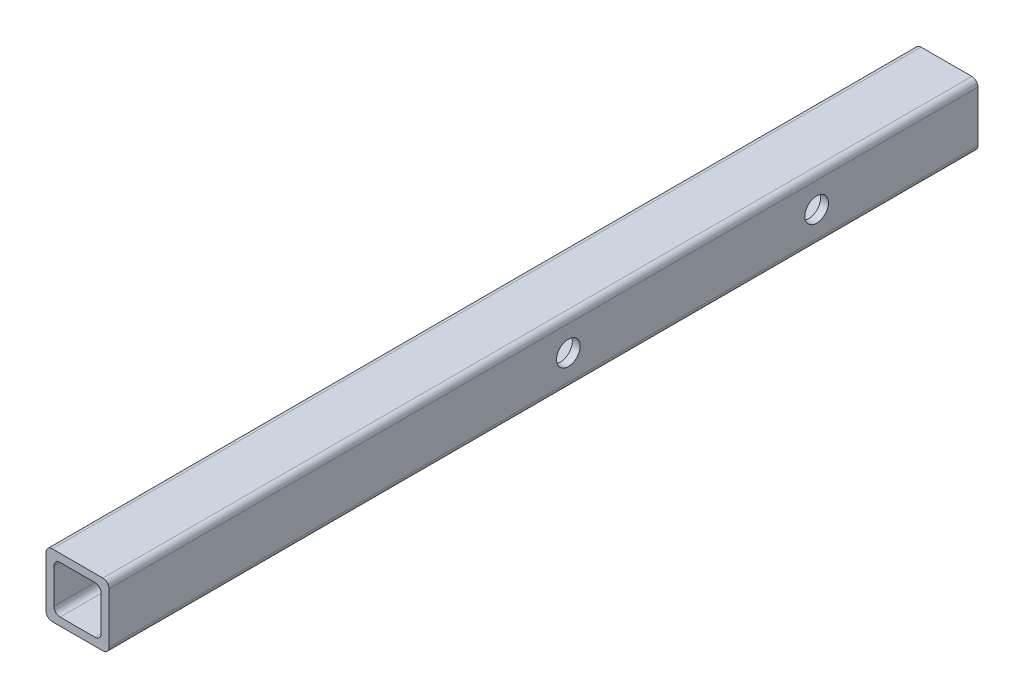
ISO-10303-21;
HEADER;
FILE_DESCRIPTION(('STEP AP214'),'2;1');
FILE_NAME('part.step','',(''),(''),'','','');
FILE_SCHEMA(('AUTOMOTIVE_DESIGN { 1 0 10303 214 1 1 1 1 }'));
ENDSEC;
DATA;
#1=APPLICATION_CONTEXT('core data for automotive mechanical design processes');
#2=APPLICATION_PROTOCOL_DEFINITION('international standard','automotive_design',2000,#1);
#3=PRODUCT_CONTEXT('',#1,'mechanical');
#4=PRODUCT('Part','Part','',(#3));
#5=PRODUCT_RELATED_PRODUCT_CATEGORY('part','',(#4));
#6=PRODUCT_DEFINITION_FORMATION('','',#4);
#7=PRODUCT_DEFINITION_CONTEXT('part definition',#1,'design');
#8=PRODUCT_DEFINITION('design','',#6,#7);
#9=PRODUCT_DEFINITION_SHAPE('','',#8);
#10=(LENGTH_UNIT() NAMED_UNIT(*) SI_UNIT(.MILLI.,.METRE.));
#11=(NAMED_UNIT(*) PLANE_ANGLE_UNIT() SI_UNIT($,.RADIAN.));
#12=(NAMED_UNIT(*) SI_UNIT($,.STERADIAN.) SOLID_ANGLE_UNIT());
#13=UNCERTAINTY_MEASURE_WITH_UNIT(LENGTH_MEASURE(1.E-05),#10,'distance_accuracy_value','');
#14=(GEOMETRIC_REPRESENTATION_CONTEXT(3) GLOBAL_UNCERTAINTY_ASSIGNED_CONTEXT((#13)) GLOBAL_UNIT_ASSIGNED_CONTEXT((#10,
#11,#12)) REPRESENTATION_CONTEXT('',''));
#15=CARTESIAN_POINT('',(0.,0.,0.));
#16=DIRECTION('',(0.,0.,1.));
#17=DIRECTION('',(1.,0.,0.));
#18=AXIS2_PLACEMENT_3D('',#15,#16,#17);
#19=CARTESIAN_POINT('',(10.2,-10.2,350.));
#20=DIRECTION('',(0.,0.,-1.));
#21=DIRECTION('',(-1.,0.,0.));
#22=AXIS2_PLACEMENT_3D('',#19,#20,#21);
#23=PLANE('',#22);
#24=CARTESIAN_POINT('',(10.2,-10.2,350.));
#25=DIRECTION('',(0.,0.,1.));
#26=DIRECTION('',(-1.,0.,0.));
#27=AXIS2_PLACEMENT_3D('',#24,#25,#26);
#28=CIRCLE('',#27,2.5);
#29=CARTESIAN_POINT('',(10.2,-12.7,350.));
#30=VERTEX_POINT('',#29);
#31=CARTESIAN_POINT('',(12.7,-10.2,350.));
#32=VERTEX_POINT('',#31);
#33=EDGE_CURVE('E245',#30,#32,#28,.T.);
#34=ORIENTED_EDGE('',*,*,#33,.T.);
#35=DIRECTION('',(0.,1.,0.));
#36=VECTOR('',#35,1.);
#37=CARTESIAN_POINT('',(12.7,-10.2,350.));
#38=LINE('',#37,#36);
#39=CARTESIAN_POINT('',(12.7,10.2,350.));
#40=VERTEX_POINT('',#39);
#41=EDGE_CURVE('E249',#32,#40,#38,.T.);
#42=ORIENTED_EDGE('',*,*,#41,.T.);
#43=CARTESIAN_POINT('',(10.2,10.2,350.));
#44=DIRECTION('',(0.,0.,1.));
#45=DIRECTION('',(1.,0.,0.));
#46=AXIS2_PLACEMENT_3D('',#43,#44,#45);
#47=CIRCLE('',#46,2.5);
#48=CARTESIAN_POINT('',(10.2,12.7,350.));
#49=VERTEX_POINT('',#48);
#50=EDGE_CURVE('E253',#40,#49,#47,.T.);
#51=ORIENTED_EDGE('',*,*,#50,.T.);
#52=DIRECTION('',(-1.,0.,0.));
#53=VECTOR('',#52,1.);
#54=CARTESIAN_POINT('',(-10.2,12.7,350.));
#55=LINE('',#54,#53);
#56=CARTESIAN_POINT('',(-10.2,12.7,350.));
#57=VERTEX_POINT('',#56);
#58=EDGE_CURVE('E256',#49,#57,#55,.T.);
#59=ORIENTED_EDGE('',*,*,#58,.T.);
#60=CARTESIAN_POINT('',(-10.2,10.2,350.));
#61=DIRECTION('',(0.,0.,1.));
#62=DIRECTION('',(1.,0.,0.));
#63=AXIS2_PLACEMENT_3D('',#60,#61,#62);
#64=CIRCLE('',#63,2.5);
#65=CARTESIAN_POINT('',(-12.7,10.2,350.));
#66=VERTEX_POINT('',#65);
#67=EDGE_CURVE('E259',#57,#66,#64,.T.);
#68=ORIENTED_EDGE('',*,*,#67,.T.);
#69=DIRECTION('',(0.,-1.,0.));
#70=VECTOR('',#69,1.);
#71=CARTESIAN_POINT('',(-12.7,-10.2,350.));
#72=LINE('',#71,#70);
#73=CARTESIAN_POINT('',(-12.7,-10.2,350.));
#74=VERTEX_POINT('',#73);
#75=EDGE_CURVE('E262',#66,#74,#72,.T.);
#76=ORIENTED_EDGE('',*,*,#75,.T.);
#77=CARTESIAN_POINT('',(-10.2,-10.2,350.));
#78=DIRECTION('',(0.,0.,1.));
#79=DIRECTION('',(-1.,0.,0.));
#80=AXIS2_PLACEMENT_3D('',#77,#78,#79);
#81=CIRCLE('',#80,2.5);
#82=CARTESIAN_POINT('',(-10.2,-12.7,350.));
#83=VERTEX_POINT('',#82);
#84=EDGE_CURVE('E265',#74,#83,#81,.T.);
#85=ORIENTED_EDGE('',*,*,#84,.T.);
#86=DIRECTION('',(1.,0.,0.));
#87=VECTOR('',#86,1.);
#88=CARTESIAN_POINT('',(-10.2,-12.7,350.));
#89=LINE('',#88,#87);
#90=EDGE_CURVE('E268',#83,#30,#89,.T.);
#91=ORIENTED_EDGE('',*,*,#90,.T.);
#92=EDGE_LOOP('',(#34,#42,#51,#59,#68,#76,#85,#91));
#93=FACE_BOUND('',#92,.T.);
#94=CARTESIAN_POINT('',(-7.02500000000001,-7.02499999999998,350.));
#95=DIRECTION('',(0.,0.,1.));
#96=DIRECTION('',(-1.,0.,0.));
#97=AXIS2_PLACEMENT_3D('',#94,#95,#96);
#98=CIRCLE('',#97,2.5);
#99=CARTESIAN_POINT('',(-9.52500000000001,-7.02499999999998,350.));
#100=VERTEX_POINT('',#99);
#101=CARTESIAN_POINT('',(-7.02500000000001,-9.52499999999998,350.));
#102=VERTEX_POINT('',#101);
#103=EDGE_CURVE('E154',#100,#102,#98,.T.);
#104=ORIENTED_EDGE('',*,*,#103,.F.);
#105=DIRECTION('',(0.,-1.,0.));
#106=VECTOR('',#105,1.);
#107=CARTESIAN_POINT('',(-9.52500000000001,-7.02499999999998,350.));
#108=LINE('',#107,#106);
#109=CARTESIAN_POINT('',(-9.52500000000001,7.025,350.));
#110=VERTEX_POINT('',#109);
#111=EDGE_CURVE('E196',#110,#100,#108,.T.);
#112=ORIENTED_EDGE('',*,*,#111,.F.);
#113=CARTESIAN_POINT('',(-7.025,7.025,350.));
#114=DIRECTION('',(0.,0.,1.));
#115=DIRECTION('',(-1.,0.,0.));
#116=AXIS2_PLACEMENT_3D('',#113,#114,#115);
#117=CIRCLE('',#116,2.5);
#118=CARTESIAN_POINT('',(-7.025,9.52500000000001,350.));
#119=VERTEX_POINT('',#118);
#120=EDGE_CURVE('E193',#119,#110,#117,.T.);
#121=ORIENTED_EDGE('',*,*,#120,.F.);
#122=DIRECTION('',(-1.,0.,0.));
#123=VECTOR('',#122,1.);
#124=CARTESIAN_POINT('',(-7.025,9.52500000000001,350.));
#125=LINE('',#124,#123);
#126=CARTESIAN_POINT('',(7.02499999999999,9.52500000000001,350.));
#127=VERTEX_POINT('',#126);
#128=EDGE_CURVE('E190',#127,#119,#125,.T.);
#129=ORIENTED_EDGE('',*,*,#128,.F.);
#130=CARTESIAN_POINT('',(7.02499999999999,7.025,350.));
#131=DIRECTION('',(0.,0.,1.));
#132=DIRECTION('',(1.,0.,0.));
#133=AXIS2_PLACEMENT_3D('',#130,#131,#132);
#134=CIRCLE('',#133,2.5);
#135=CARTESIAN_POINT('',(9.52499999999999,7.025,350.));
#136=VERTEX_POINT('',#135);
#137=EDGE_CURVE('E187',#136,#127,#134,.T.);
#138=ORIENTED_EDGE('',*,*,#137,.F.);
#139=DIRECTION('',(0.,1.,0.));
#140=VECTOR('',#139,1.);
#141=CARTESIAN_POINT('',(9.52499999999999,-7.02499999999998,350.));
#142=LINE('',#141,#140);
#143=CARTESIAN_POINT('',(9.52499999999999,-7.02499999999998,350.));
#144=VERTEX_POINT('',#143);
#145=EDGE_CURVE('E181',#144,#136,#142,.T.);
#146=ORIENTED_EDGE('',*,*,#145,.F.);
#147=CARTESIAN_POINT('',(7.02499999999999,-7.02499999999998,350.));
#148=DIRECTION('',(0.,0.,1.));
#149=DIRECTION('',(1.,0.,0.));
#150=AXIS2_PLACEMENT_3D('',#147,#148,#149);
#151=CIRCLE('',#150,2.5);
#152=CARTESIAN_POINT('',(7.02499999999999,-9.52499999999998,350.));
#153=VERTEX_POINT('',#152);
#154=EDGE_CURVE('E177',#153,#144,#151,.T.);
#155=ORIENTED_EDGE('',*,*,#154,.F.);
#156=DIRECTION('',(1.,0.,0.));
#157=VECTOR('',#156,1.);
#158=CARTESIAN_POINT('',(-7.02500000000001,-9.52499999999998,350.));
#159=LINE('',#158,#157);
#160=EDGE_CURVE('E163',#102,#153,#159,.T.);
#161=ORIENTED_EDGE('',*,*,#160,.F.);
#162=EDGE_LOOP('',(#104,#112,#121,#129,#138,#146,#155,#161));
#163=FACE_BOUND('',#162,.T.);
#164=ADVANCED_FACE('F38',(#93,#163),#23,.F.);
#165=CARTESIAN_POINT('',(10.2,-10.2,0.));
#166=DIRECTION('',(0.,0.,-1.));
#167=DIRECTION('',(-1.,0.,0.));
#168=AXIS2_PLACEMENT_3D('',#165,#166,#167);
#169=PLANE('',#168);
#170=CARTESIAN_POINT('',(10.2,-10.2,0.));
#171=DIRECTION('',(0.,0.,1.));
#172=DIRECTION('',(-1.,0.,0.));
#173=AXIS2_PLACEMENT_3D('',#170,#171,#172);
#174=CIRCLE('',#173,2.5);
#175=CARTESIAN_POINT('',(10.2,-12.7,0.));
#176=VERTEX_POINT('',#175);
#177=CARTESIAN_POINT('',(12.7,-10.2,0.));
#178=VERTEX_POINT('',#177);
#179=EDGE_CURVE('E172',#176,#178,#174,.T.);
#180=ORIENTED_EDGE('',*,*,#179,.F.);
#181=DIRECTION('',(1.,0.,0.));
#182=VECTOR('',#181,1.);
#183=CARTESIAN_POINT('',(-10.2,-12.7,0.));
#184=LINE('',#183,#182);
#185=CARTESIAN_POINT('',(-10.2,-12.7,0.));
#186=VERTEX_POINT('',#185);
#187=EDGE_CURVE('E250',#186,#176,#184,.T.);
#188=ORIENTED_EDGE('',*,*,#187,.F.);
#189=CARTESIAN_POINT('',(-10.2,-10.2,0.));
#190=DIRECTION('',(0.,0.,1.));
#191=DIRECTION('',(-1.,0.,0.));
#192=AXIS2_PLACEMENT_3D('',#189,#190,#191);
#193=CIRCLE('',#192,2.5);
#194=CARTESIAN_POINT('',(-12.7,-10.2,0.));
#195=VERTEX_POINT('',#194);
#196=EDGE_CURVE('E290',#195,#186,#193,.T.);
#197=ORIENTED_EDGE('',*,*,#196,.F.);
#198=DIRECTION('',(0.,-1.,0.));
#199=VECTOR('',#198,1.);
#200=CARTESIAN_POINT('',(-12.7,-10.2,0.));
#201=LINE('',#200,#199);
#202=CARTESIAN_POINT('',(-12.7,10.2,0.));
#203=VERTEX_POINT('',#202);
#204=EDGE_CURVE('E287',#203,#195,#201,.T.);
#205=ORIENTED_EDGE('',*,*,#204,.F.);
#206=CARTESIAN_POINT('',(-10.2,10.2,0.));
#207=DIRECTION('',(0.,0.,1.));
#208=DIRECTION('',(1.,0.,0.));
#209=AXIS2_PLACEMENT_3D('',#206,#207,#208);
#210=CIRCLE('',#209,2.5);
#211=CARTESIAN_POINT('',(-10.2,12.7,0.));
#212=VERTEX_POINT('',#211);
#213=EDGE_CURVE('E284',#212,#203,#210,.T.);
#214=ORIENTED_EDGE('',*,*,#213,.F.);
#215=DIRECTION('',(-1.,0.,0.));
#216=VECTOR('',#215,1.);
#217=CARTESIAN_POINT('',(-10.2,12.7,0.));
#218=LINE('',#217,#216);
#219=CARTESIAN_POINT('',(10.2,12.7,0.));
#220=VERTEX_POINT('',#219);
#221=EDGE_CURVE('E281',#220,#212,#218,.T.);
#222=ORIENTED_EDGE('',*,*,#221,.F.);
#223=CARTESIAN_POINT('',(10.2,10.2,0.));
#224=DIRECTION('',(0.,0.,1.));
#225=DIRECTION('',(1.,0.,0.));
#226=AXIS2_PLACEMENT_3D('',#223,#224,#225);
#227=CIRCLE('',#226,2.5);
#228=CARTESIAN_POINT('',(12.7,10.2,0.));
#229=VERTEX_POINT('',#228);
#230=EDGE_CURVE('E278',#229,#220,#227,.T.);
#231=ORIENTED_EDGE('',*,*,#230,.F.);
#232=DIRECTION('',(0.,1.,0.));
#233=VECTOR('',#232,1.);
#234=CARTESIAN_POINT('',(12.7,-10.2,0.));
#235=LINE('',#234,#233);
#236=EDGE_CURVE('E275',#178,#229,#235,.T.);
#237=ORIENTED_EDGE('',*,*,#236,.F.);
#238=EDGE_LOOP('',(#180,#188,#197,#205,#214,#222,#231,#237));
#239=FACE_BOUND('',#238,.T.);
#240=DIRECTION('',(0.,-1.,0.));
#241=VECTOR('',#240,1.);
#242=CARTESIAN_POINT('',(-9.52500000000001,-7.02499999999998,0.));
#243=LINE('',#242,#241);
#244=CARTESIAN_POINT('',(-9.52500000000001,7.02500000000001,0.));
#245=VERTEX_POINT('',#244);
#246=CARTESIAN_POINT('',(-9.52500000000001,-7.02499999999998,0.));
#247=VERTEX_POINT('',#246);
#248=EDGE_CURVE('E164',#245,#247,#243,.T.);
#249=ORIENTED_EDGE('',*,*,#248,.T.);
#250=CARTESIAN_POINT('',(-7.02500000000001,-7.02499999999998,0.));
#251=DIRECTION('',(0.,0.,1.));
#252=DIRECTION('',(-1.,0.,0.));
#253=AXIS2_PLACEMENT_3D('',#250,#251,#252);
#254=CIRCLE('',#253,2.5);
#255=CARTESIAN_POINT('',(-7.02500000000001,-9.52499999999998,0.));
#256=VERTEX_POINT('',#255);
#257=EDGE_CURVE('E64',#247,#256,#254,.T.);
#258=ORIENTED_EDGE('',*,*,#257,.T.);
#259=DIRECTION('',(1.,0.,0.));
#260=VECTOR('',#259,1.);
#261=CARTESIAN_POINT('',(-7.02500000000001,-9.52499999999998,0.));
#262=LINE('',#261,#260);
#263=CARTESIAN_POINT('',(7.02499999999999,-9.52499999999998,0.));
#264=VERTEX_POINT('',#263);
#265=EDGE_CURVE('E170',#256,#264,#262,.T.);
#266=ORIENTED_EDGE('',*,*,#265,.T.);
#267=CARTESIAN_POINT('',(7.02499999999999,-7.02499999999998,0.));
#268=DIRECTION('',(0.,0.,1.));
#269=DIRECTION('',(1.,0.,0.));
#270=AXIS2_PLACEMENT_3D('',#267,#268,#269);
#271=CIRCLE('',#270,2.5);
#272=CARTESIAN_POINT('',(9.52499999999999,-7.02499999999998,0.));
#273=VERTEX_POINT('',#272);
#274=EDGE_CURVE('E204',#264,#273,#271,.T.);
#275=ORIENTED_EDGE('',*,*,#274,.T.);
#276=DIRECTION('',(0.,1.,0.));
#277=VECTOR('',#276,1.);
#278=CARTESIAN_POINT('',(9.52499999999999,-7.02499999999998,0.));
#279=LINE('',#278,#277);
#280=CARTESIAN_POINT('',(9.52499999999999,7.025,0.));
#281=VERTEX_POINT('',#280);
#282=EDGE_CURVE('E208',#273,#281,#279,.T.);
#283=ORIENTED_EDGE('',*,*,#282,.T.);
#284=CARTESIAN_POINT('',(7.02499999999999,7.025,0.));
#285=DIRECTION('',(0.,0.,1.));
#286=DIRECTION('',(1.,0.,0.));
#287=AXIS2_PLACEMENT_3D('',#284,#285,#286);
#288=CIRCLE('',#287,2.5);
#289=CARTESIAN_POINT('',(7.02499999999999,9.52500000000001,0.));
#290=VERTEX_POINT('',#289);
#291=EDGE_CURVE('E212',#281,#290,#288,.T.);
#292=ORIENTED_EDGE('',*,*,#291,.T.);
#293=DIRECTION('',(-1.,0.,0.));
#294=VECTOR('',#293,1.);
#295=CARTESIAN_POINT('',(-7.025,9.52500000000001,0.));
#296=LINE('',#295,#294);
#297=CARTESIAN_POINT('',(-7.025,9.52500000000001,0.));
#298=VERTEX_POINT('',#297);
#299=EDGE_CURVE('E216',#290,#298,#296,.T.);
#300=ORIENTED_EDGE('',*,*,#299,.T.);
#301=CARTESIAN_POINT('',(-7.025,7.025,0.));
#302=DIRECTION('',(0.,0.,1.));
#303=DIRECTION('',(-1.,0.,0.));
#304=AXIS2_PLACEMENT_3D('',#301,#302,#303);
#305=CIRCLE('',#304,2.5);
#306=EDGE_CURVE('E220',#298,#245,#305,.T.);
#307=ORIENTED_EDGE('',*,*,#306,.T.);
#308=EDGE_LOOP('',(#249,#258,#266,#275,#283,#292,#300,#307));
#309=FACE_BOUND('',#308,.T.);
#310=ADVANCED_FACE('F366',(#239,#309),#169,.T.);
#311=CARTESIAN_POINT('',(10.2,-10.2,350.));
#312=DIRECTION('',(0.,0.,-1.));
#313=DIRECTION('',(-1.,0.,0.));
#314=AXIS2_PLACEMENT_3D('',#311,#312,#313);
#315=CYLINDRICAL_SURFACE('',#314,2.5);
#316=ORIENTED_EDGE('',*,*,#179,.T.);
#317=DIRECTION('',(0.,0.,-1.));
#318=VECTOR('',#317,1.);
#319=CARTESIAN_POINT('',(12.7,-10.2,350.));
#320=LINE('',#319,#318);
#321=EDGE_CURVE('E11',#32,#178,#320,.T.);
#322=ORIENTED_EDGE('',*,*,#321,.F.);
#323=ORIENTED_EDGE('',*,*,#33,.F.);
#324=DIRECTION('',(0.,0.,-1.));
#325=VECTOR('',#324,1.);
#326=CARTESIAN_POINT('',(10.2,-12.7,350.));
#327=LINE('',#326,#325);
#328=EDGE_CURVE('E271',#30,#176,#327,.T.);
#329=ORIENTED_EDGE('',*,*,#328,.T.);
#330=EDGE_LOOP('',(#316,#322,#323,#329));
#331=FACE_BOUND('',#330,.T.);
#332=ADVANCED_FACE('F40',(#331),#315,.T.);
#333=CARTESIAN_POINT('',(12.7,-10.2,350.));
#334=DIRECTION('',(-1.,0.,0.));
#335=DIRECTION('',(0.,-1.,0.));
#336=AXIS2_PLACEMENT_3D('',#333,#334,#335);
#337=PLANE('',#336);
#338=CARTESIAN_POINT('',(12.7,0.,65.));
#339=DIRECTION('',(-1.,0.,0.));
#340=DIRECTION('',(0.,0.,1.));
#341=AXIS2_PLACEMENT_3D('',#338,#339,#340);
#342=CIRCLE('',#341,4.7625);
#343=CARTESIAN_POINT('',(12.7,0.,69.7625));
#344=VERTEX_POINT('',#343);
#345=EDGE_CURVE('E324',#344,#344,#342,.T.);
#346=ORIENTED_EDGE('',*,*,#345,.T.);
#347=EDGE_LOOP('',(#346));
#348=FACE_BOUND('',#347,.T.);
#349=CARTESIAN_POINT('',(12.7,0.,165.));
#350=DIRECTION('',(-1.,0.,0.));
#351=DIRECTION('',(0.,0.,1.));
#352=AXIS2_PLACEMENT_3D('',#349,#350,#351);
#353=CIRCLE('',#352,4.76250000000001);
#354=CARTESIAN_POINT('',(12.7,0.,169.7625));
#355=VERTEX_POINT('',#354);
#356=EDGE_CURVE('E338',#355,#355,#353,.T.);
#357=ORIENTED_EDGE('',*,*,#356,.T.);
#358=EDGE_LOOP('',(#357));
#359=FACE_BOUND('',#358,.T.);
#360=ORIENTED_EDGE('',*,*,#236,.T.);
#361=DIRECTION('',(0.,0.,-1.));
#362=VECTOR('',#361,1.);
#363=CARTESIAN_POINT('',(12.7,10.2,350.));
#364=LINE('',#363,#362);
#365=EDGE_CURVE('E48',#40,#229,#364,.T.);
#366=ORIENTED_EDGE('',*,*,#365,.F.);
#367=ORIENTED_EDGE('',*,*,#41,.F.);
#368=ORIENTED_EDGE('',*,*,#321,.T.);
#369=EDGE_LOOP('',(#360,#366,#367,#368));
#370=FACE_BOUND('',#369,.T.);
#371=ADVANCED_FACE('F429',(#348,#359,#370),#337,.F.);
#372=CARTESIAN_POINT('',(10.2,10.2,350.));
#373=DIRECTION('',(0.,0.,-1.));
#374=DIRECTION('',(-1.,0.,0.));
#375=AXIS2_PLACEMENT_3D('',#372,#373,#374);
#376=CYLINDRICAL_SURFACE('',#375,2.5);
#377=ORIENTED_EDGE('',*,*,#230,.T.);
#378=DIRECTION('',(0.,0.,-1.));
#379=VECTOR('',#378,1.);
#380=CARTESIAN_POINT('',(10.2,12.7,350.));
#381=LINE('',#380,#379);
#382=EDGE_CURVE('E314',#49,#220,#381,.T.);
#383=ORIENTED_EDGE('',*,*,#382,.F.);
#384=ORIENTED_EDGE('',*,*,#50,.F.);
#385=ORIENTED_EDGE('',*,*,#365,.T.);
#386=EDGE_LOOP('',(#377,#383,#384,#385));
#387=FACE_BOUND('',#386,.T.);
#388=ADVANCED_FACE('F426',(#387),#376,.T.);
#389=CARTESIAN_POINT('',(-10.2,12.7,350.));
#390=DIRECTION('',(0.,-1.,0.));
#391=DIRECTION('',(1.,0.,0.));
#392=AXIS2_PLACEMENT_3D('',#389,#390,#391);
#393=PLANE('',#392);
#394=ORIENTED_EDGE('',*,*,#221,.T.);
#395=DIRECTION('',(0.,0.,-1.));
#396=VECTOR('',#395,1.);
#397=CARTESIAN_POINT('',(-10.2,12.7,350.));
#398=LINE('',#397,#396);
#399=EDGE_CURVE('E310',#57,#212,#398,.T.);
#400=ORIENTED_EDGE('',*,*,#399,.F.);
#401=ORIENTED_EDGE('',*,*,#58,.F.);
#402=ORIENTED_EDGE('',*,*,#382,.T.);
#403=EDGE_LOOP('',(#394,#400,#401,#402));
#404=FACE_BOUND('',#403,.T.);
#405=ADVANCED_FACE('F422',(#404),#393,.F.);
#406=CARTESIAN_POINT('',(-10.2,10.2,350.));
#407=DIRECTION('',(0.,0.,-1.));
#408=DIRECTION('',(-1.,0.,0.));
#409=AXIS2_PLACEMENT_3D('',#406,#407,#408);
#410=CYLINDRICAL_SURFACE('',#409,2.5);
#411=ORIENTED_EDGE('',*,*,#213,.T.);
#412=DIRECTION('',(0.,0.,-1.));
#413=VECTOR('',#412,1.);
#414=CARTESIAN_POINT('',(-12.7,10.2,350.));
#415=LINE('',#414,#413);
#416=EDGE_CURVE('E306',#66,#203,#415,.T.);
#417=ORIENTED_EDGE('',*,*,#416,.F.);
#418=ORIENTED_EDGE('',*,*,#67,.F.);
#419=ORIENTED_EDGE('',*,*,#399,.T.);
#420=EDGE_LOOP('',(#411,#417,#418,#419));
#421=FACE_BOUND('',#420,.T.);
#422=ADVANCED_FACE('F418',(#421),#410,.T.);
#423=CARTESIAN_POINT('',(-12.7,-10.2,350.));
#424=DIRECTION('',(1.,0.,0.));
#425=DIRECTION('',(0.,0.,-1.));
#426=AXIS2_PLACEMENT_3D('',#423,#424,#425);
#427=PLANE('',#426);
#428=CARTESIAN_POINT('',(-12.7,0.,65.));
#429=DIRECTION('',(-1.,0.,0.));
#430=DIRECTION('',(0.,0.,1.));
#431=AXIS2_PLACEMENT_3D('',#428,#429,#430);
#432=CIRCLE('',#431,4.7625);
#433=CARTESIAN_POINT('',(-12.7,0.,69.7625));
#434=VERTEX_POINT('',#433);
#435=EDGE_CURVE('E332',#434,#434,#432,.T.);
#436=ORIENTED_EDGE('',*,*,#435,.F.);
#437=EDGE_LOOP('',(#436));
#438=FACE_BOUND('',#437,.T.);
#439=CARTESIAN_POINT('',(-12.7,0.,165.));
#440=DIRECTION('',(-1.,0.,0.));
#441=DIRECTION('',(0.,0.,1.));
#442=AXIS2_PLACEMENT_3D('',#439,#440,#441);
#443=CIRCLE('',#442,4.76250000000001);
#444=CARTESIAN_POINT('',(-12.7,0.,169.7625));
#445=VERTEX_POINT('',#444);
#446=EDGE_CURVE('E344',#445,#445,#443,.T.);
#447=ORIENTED_EDGE('',*,*,#446,.F.);
#448=EDGE_LOOP('',(#447));
#449=FACE_BOUND('',#448,.T.);
#450=ORIENTED_EDGE('',*,*,#204,.T.);
#451=DIRECTION('',(0.,0.,-1.));
#452=VECTOR('',#451,1.);
#453=CARTESIAN_POINT('',(-12.7,-10.2,350.));
#454=LINE('',#453,#452);
#455=EDGE_CURVE('E302',#74,#195,#454,.T.);
#456=ORIENTED_EDGE('',*,*,#455,.F.);
#457=ORIENTED_EDGE('',*,*,#75,.F.);
#458=ORIENTED_EDGE('',*,*,#416,.T.);
#459=EDGE_LOOP('',(#450,#456,#457,#458));
#460=FACE_BOUND('',#459,.T.);
#461=ADVANCED_FACE('F414',(#438,#449,#460),#427,.F.);
#462=CARTESIAN_POINT('',(-10.2,-10.2,350.));
#463=DIRECTION('',(0.,0.,-1.));
#464=DIRECTION('',(-1.,0.,0.));
#465=AXIS2_PLACEMENT_3D('',#462,#463,#464);
#466=CYLINDRICAL_SURFACE('',#465,2.5);
#467=ORIENTED_EDGE('',*,*,#196,.T.);
#468=DIRECTION('',(0.,0.,-1.));
#469=VECTOR('',#468,1.);
#470=CARTESIAN_POINT('',(-10.2,-12.7,350.));
#471=LINE('',#470,#469);
#472=EDGE_CURVE('E298',#83,#186,#471,.T.);
#473=ORIENTED_EDGE('',*,*,#472,.F.);
#474=ORIENTED_EDGE('',*,*,#84,.F.);
#475=ORIENTED_EDGE('',*,*,#455,.T.);
#476=EDGE_LOOP('',(#467,#473,#474,#475));
#477=FACE_BOUND('',#476,.T.);
#478=ADVANCED_FACE('F410',(#477),#466,.T.);
#479=CARTESIAN_POINT('',(-10.2,-12.7,350.));
#480=DIRECTION('',(0.,1.,0.));
#481=DIRECTION('',(0.,0.,1.));
#482=AXIS2_PLACEMENT_3D('',#479,#480,#481);
#483=PLANE('',#482);
#484=ORIENTED_EDGE('',*,*,#187,.T.);
#485=ORIENTED_EDGE('',*,*,#328,.F.);
#486=ORIENTED_EDGE('',*,*,#90,.F.);
#487=ORIENTED_EDGE('',*,*,#472,.T.);
#488=EDGE_LOOP('',(#484,#485,#486,#487));
#489=FACE_BOUND('',#488,.T.);
#490=ADVANCED_FACE('F407',(#489),#483,.F.);
#491=CARTESIAN_POINT('',(-7.02500000000001,-7.02499999999998,350.));
#492=DIRECTION('',(0.,0.,-1.));
#493=DIRECTION('',(-1.,0.,0.));
#494=AXIS2_PLACEMENT_3D('',#491,#492,#493);
#495=CYLINDRICAL_SURFACE('',#494,2.5);
#496=ORIENTED_EDGE('',*,*,#257,.F.);
#497=DIRECTION('',(0.,0.,-1.));
#498=VECTOR('',#497,1.);
#499=CARTESIAN_POINT('',(-9.52500000000001,-7.02499999999998,350.));
#500=LINE('',#499,#498);
#501=EDGE_CURVE('E158',#100,#247,#500,.T.);
#502=ORIENTED_EDGE('',*,*,#501,.F.);
#503=ORIENTED_EDGE('',*,*,#103,.T.);
#504=DIRECTION('',(0.,0.,-1.));
#505=VECTOR('',#504,1.);
#506=CARTESIAN_POINT('',(-7.02500000000001,-9.52499999999998,350.));
#507=LINE('',#506,#505);
#508=EDGE_CURVE('E157',#102,#256,#507,.T.);
#509=ORIENTED_EDGE('',*,*,#508,.T.);
#510=EDGE_LOOP('',(#496,#502,#503,#509));
#511=FACE_BOUND('',#510,.T.);
#512=ADVANCED_FACE('F156',(#511),#495,.F.);
#513=CARTESIAN_POINT('',(-7.02500000000001,-9.52499999999998,350.));
#514=DIRECTION('',(0.,1.,0.));
#515=DIRECTION('',(0.,0.,1.));
#516=AXIS2_PLACEMENT_3D('',#513,#514,#515);
#517=PLANE('',#516);
#518=ORIENTED_EDGE('',*,*,#265,.F.);
#519=ORIENTED_EDGE('',*,*,#508,.F.);
#520=ORIENTED_EDGE('',*,*,#160,.T.);
#521=DIRECTION('',(0.,0.,-1.));
#522=VECTOR('',#521,1.);
#523=CARTESIAN_POINT('',(7.02499999999999,-9.52499999999998,350.));
#524=LINE('',#523,#522);
#525=EDGE_CURVE('E173',#153,#264,#524,.T.);
#526=ORIENTED_EDGE('',*,*,#525,.T.);
#527=EDGE_LOOP('',(#518,#519,#520,#526));
#528=FACE_BOUND('',#527,.T.);
#529=ADVANCED_FACE('F167',(#528),#517,.T.);
#530=CARTESIAN_POINT('',(7.02499999999999,-7.02499999999998,350.));
#531=DIRECTION('',(0.,0.,-1.));
#532=DIRECTION('',(-1.,0.,0.));
#533=AXIS2_PLACEMENT_3D('',#530,#531,#532);
#534=CYLINDRICAL_SURFACE('',#533,2.5);
#535=ORIENTED_EDGE('',*,*,#274,.F.);
#536=ORIENTED_EDGE('',*,*,#525,.F.);
#537=ORIENTED_EDGE('',*,*,#154,.T.);
#538=DIRECTION('',(0.,0.,-1.));
#539=VECTOR('',#538,1.);
#540=CARTESIAN_POINT('',(9.52499999999999,-7.02499999999998,350.));
#541=LINE('',#540,#539);
#542=EDGE_CURVE('E240',#144,#273,#541,.T.);
#543=ORIENTED_EDGE('',*,*,#542,.T.);
#544=EDGE_LOOP('',(#535,#536,#537,#543));
#545=FACE_BOUND('',#544,.T.);
#546=ADVANCED_FACE('F386',(#545),#534,.F.);
#547=CARTESIAN_POINT('',(9.52499999999999,-7.02499999999998,350.));
#548=DIRECTION('',(-1.,0.,0.));
#549=DIRECTION('',(0.,-1.,0.));
#550=AXIS2_PLACEMENT_3D('',#547,#548,#549);
#551=PLANE('',#550);
#552=CARTESIAN_POINT('',(9.52499999999999,0.,65.));
#553=DIRECTION('',(-1.,0.,0.));
#554=DIRECTION('',(0.,-1.,0.));
#555=AXIS2_PLACEMENT_3D('',#552,#553,#554);
#556=CIRCLE('',#555,4.7625);
#557=CARTESIAN_POINT('',(9.52499999999999,-4.7625,65.));
#558=VERTEX_POINT('',#557);
#559=EDGE_CURVE('E201',#558,#558,#556,.T.);
#560=ORIENTED_EDGE('',*,*,#559,.F.);
#561=EDGE_LOOP('',(#560));
#562=FACE_BOUND('',#561,.T.);
#563=CARTESIAN_POINT('',(9.52499999999999,0.,165.));
#564=DIRECTION('',(-1.,0.,0.));
#565=DIRECTION('',(0.,-1.,0.));
#566=AXIS2_PLACEMENT_3D('',#563,#564,#565);
#567=CIRCLE('',#566,4.76250000000001);
#568=CARTESIAN_POINT('',(9.52499999999999,-4.76250000000001,165.));
#569=VERTEX_POINT('',#568);
#570=EDGE_CURVE('E323',#569,#569,#567,.T.);
#571=ORIENTED_EDGE('',*,*,#570,.F.);
#572=EDGE_LOOP('',(#571));
#573=FACE_BOUND('',#572,.T.);
#574=ORIENTED_EDGE('',*,*,#282,.F.);
#575=ORIENTED_EDGE('',*,*,#542,.F.);
#576=ORIENTED_EDGE('',*,*,#145,.T.);
#577=DIRECTION('',(0.,0.,-1.));
#578=VECTOR('',#577,1.);
#579=CARTESIAN_POINT('',(9.52499999999999,7.025,350.));
#580=LINE('',#579,#578);
#581=EDGE_CURVE('E237',#136,#281,#580,.T.);
#582=ORIENTED_EDGE('',*,*,#581,.T.);
#583=EDGE_LOOP('',(#574,#575,#576,#582));
#584=FACE_BOUND('',#583,.T.);
#585=ADVANCED_FACE('F382',(#562,#573,#584),#551,.T.);
#586=CARTESIAN_POINT('',(7.02499999999999,7.025,350.));
#587=DIRECTION('',(0.,0.,-1.));
#588=DIRECTION('',(-1.,0.,0.));
#589=AXIS2_PLACEMENT_3D('',#586,#587,#588);
#590=CYLINDRICAL_SURFACE('',#589,2.5);
#591=ORIENTED_EDGE('',*,*,#291,.F.);
#592=ORIENTED_EDGE('',*,*,#581,.F.);
#593=ORIENTED_EDGE('',*,*,#137,.T.);
#594=DIRECTION('',(0.,0.,-1.));
#595=VECTOR('',#594,1.);
#596=CARTESIAN_POINT('',(7.02499999999999,9.52500000000001,350.));
#597=LINE('',#596,#595);
#598=EDGE_CURVE('E234',#127,#290,#597,.T.);
#599=ORIENTED_EDGE('',*,*,#598,.T.);
#600=EDGE_LOOP('',(#591,#592,#593,#599));
#601=FACE_BOUND('',#600,.T.);
#602=ADVANCED_FACE('F378',(#601),#590,.F.);
#603=CARTESIAN_POINT('',(-7.025,9.52500000000001,350.));
#604=DIRECTION('',(0.,-1.,0.));
#605=DIRECTION('',(0.,0.,-1.));
#606=AXIS2_PLACEMENT_3D('',#603,#604,#605);
#607=PLANE('',#606);
#608=ORIENTED_EDGE('',*,*,#299,.F.);
#609=ORIENTED_EDGE('',*,*,#598,.F.);
#610=ORIENTED_EDGE('',*,*,#128,.T.);
#611=DIRECTION('',(0.,0.,-1.));
#612=VECTOR('',#611,1.);
#613=CARTESIAN_POINT('',(-7.025,9.52500000000001,350.));
#614=LINE('',#613,#612);
#615=EDGE_CURVE('E231',#119,#298,#614,.T.);
#616=ORIENTED_EDGE('',*,*,#615,.T.);
#617=EDGE_LOOP('',(#608,#609,#610,#616));
#618=FACE_BOUND('',#617,.T.);
#619=ADVANCED_FACE('F375',(#618),#607,.T.);
#620=CARTESIAN_POINT('',(-7.025,7.025,350.));
#621=DIRECTION('',(0.,0.,-1.));
#622=DIRECTION('',(-1.,0.,0.));
#623=AXIS2_PLACEMENT_3D('',#620,#621,#622);
#624=CYLINDRICAL_SURFACE('',#623,2.5);
#625=ORIENTED_EDGE('',*,*,#306,.F.);
#626=ORIENTED_EDGE('',*,*,#615,.F.);
#627=ORIENTED_EDGE('',*,*,#120,.T.);
#628=DIRECTION('',(0.,0.,-1.));
#629=VECTOR('',#628,1.);
#630=CARTESIAN_POINT('',(-9.52500000000001,7.02500000000001,350.));
#631=LINE('',#630,#629);
#632=EDGE_CURVE('E56',#110,#245,#631,.T.);
#633=ORIENTED_EDGE('',*,*,#632,.T.);
#634=EDGE_LOOP('',(#625,#626,#627,#633));
#635=FACE_BOUND('',#634,.T.);
#636=ADVANCED_FACE('F362',(#635),#624,.F.);
#637=CARTESIAN_POINT('',(-9.52500000000001,-7.02499999999998,350.));
#638=DIRECTION('',(1.,0.,0.));
#639=DIRECTION('',(0.,0.,-1.));
#640=AXIS2_PLACEMENT_3D('',#637,#638,#639);
#641=PLANE('',#640);
#642=CARTESIAN_POINT('',(-9.52500000000001,0.,65.));
#643=DIRECTION('',(1.,0.,0.));
#644=DIRECTION('',(0.,0.,-1.));
#645=AXIS2_PLACEMENT_3D('',#642,#643,#644);
#646=CIRCLE('',#645,4.7625);
#647=CARTESIAN_POINT('',(-9.52500000000001,0.,60.2375));
#648=VERTEX_POINT('',#647);
#649=EDGE_CURVE('E42',#648,#648,#646,.T.);
#650=ORIENTED_EDGE('',*,*,#649,.F.);
#651=EDGE_LOOP('',(#650));
#652=FACE_BOUND('',#651,.T.);
#653=CARTESIAN_POINT('',(-9.52500000000001,0.,165.));
#654=DIRECTION('',(1.,0.,0.));
#655=DIRECTION('',(0.,0.,-1.));
#656=AXIS2_PLACEMENT_3D('',#653,#654,#655);
#657=CIRCLE('',#656,4.76250000000001);
#658=CARTESIAN_POINT('',(-9.52500000000001,0.,160.2375));
#659=VERTEX_POINT('',#658);
#660=EDGE_CURVE('E320',#659,#659,#657,.T.);
#661=ORIENTED_EDGE('',*,*,#660,.F.);
#662=EDGE_LOOP('',(#661));
#663=FACE_BOUND('',#662,.T.);
#664=ORIENTED_EDGE('',*,*,#248,.F.);
#665=ORIENTED_EDGE('',*,*,#632,.F.);
#666=ORIENTED_EDGE('',*,*,#111,.T.);
#667=ORIENTED_EDGE('',*,*,#501,.T.);
#668=EDGE_LOOP('',(#664,#665,#666,#667));
#669=FACE_BOUND('',#668,.T.);
#670=ADVANCED_FACE('F358',(#652,#663,#669),#641,.T.);
#671=CARTESIAN_POINT('',(12.7,0.,165.));
#672=DIRECTION('',(-1.,0.,0.));
#673=DIRECTION('',(0.,0.,1.));
#674=AXIS2_PLACEMENT_3D('',#671,#672,#673);
#675=CYLINDRICAL_SURFACE('',#674,4.76250000000001);
#676=ORIENTED_EDGE('',*,*,#660,.T.);
#677=EDGE_LOOP('',(#676));
#678=FACE_BOUND('',#677,.T.);
#679=ORIENTED_EDGE('',*,*,#446,.T.);
#680=EDGE_LOOP('',(#679));
#681=FACE_BOUND('',#680,.T.);
#682=ADVANCED_FACE('F361',(#678,#681),#675,.F.);
#683=CARTESIAN_POINT('',(12.7,0.,65.));
#684=DIRECTION('',(-1.,0.,0.));
#685=DIRECTION('',(0.,0.,1.));
#686=AXIS2_PLACEMENT_3D('',#683,#684,#685);
#687=CYLINDRICAL_SURFACE('',#686,4.7625);
#688=ORIENTED_EDGE('',*,*,#649,.T.);
#689=EDGE_LOOP('',(#688));
#690=FACE_BOUND('',#689,.T.);
#691=ORIENTED_EDGE('',*,*,#435,.T.);
#692=EDGE_LOOP('',(#691));
#693=FACE_BOUND('',#692,.T.);
#694=ADVANCED_FACE('F355',(#690,#693),#687,.F.);
#695=ORIENTED_EDGE('',*,*,#570,.T.);
#696=EDGE_LOOP('',(#695));
#697=FACE_BOUND('',#696,.T.);
#698=ORIENTED_EDGE('',*,*,#356,.F.);
#699=EDGE_LOOP('',(#698));
#700=FACE_BOUND('',#699,.T.);
#701=ADVANCED_FACE('F464',(#697,#700),#675,.F.);
#702=ORIENTED_EDGE('',*,*,#559,.T.);
#703=EDGE_LOOP('',(#702));
#704=FACE_BOUND('',#703,.T.);
#705=ORIENTED_EDGE('',*,*,#345,.F.);
#706=EDGE_LOOP('',(#705));
#707=FACE_BOUND('',#706,.T.);
#708=ADVANCED_FACE('F466',(#704,#707),#687,.F.);
#709=CLOSED_SHELL('',(#164,#310,#332,#371,#388,#405,#422,#461,#478,#490,#512,#529,#546,#585,
#602,#619,#636,#670,#682,#694,#701,#708));
#710=MANIFOLD_SOLID_BREP('B2',#709);
#711=ADVANCED_BREP_SHAPE_REPRESENTATION('',(#18,#710),#14);
#712=SHAPE_DEFINITION_REPRESENTATION(#9,#711);
ENDSEC;
END-ISO-10303-21;
